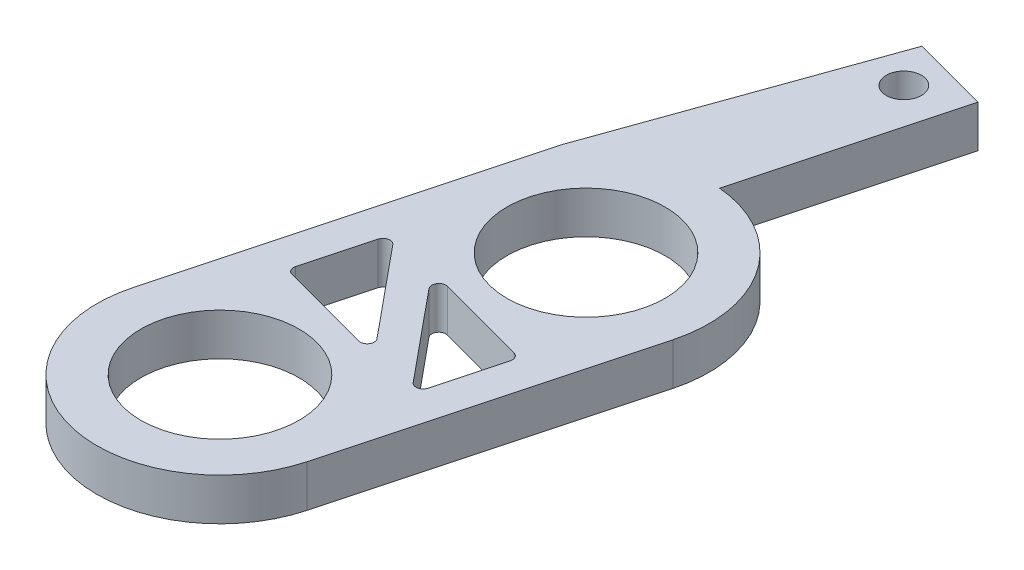
ISO-10303-21;
HEADER;
FILE_DESCRIPTION(('STEP AP214'),'2;1');
FILE_NAME('part.step','',(''),(''),'','','');
FILE_SCHEMA(('AUTOMOTIVE_DESIGN { 1 0 10303 214 1 1 1 1 }'));
ENDSEC;
DATA;
#1=APPLICATION_CONTEXT('core data for automotive mechanical design processes');
#2=APPLICATION_PROTOCOL_DEFINITION('international standard','automotive_design',2000,#1);
#3=PRODUCT_CONTEXT('',#1,'mechanical');
#4=PRODUCT('Part','Part','',(#3));
#5=PRODUCT_RELATED_PRODUCT_CATEGORY('part','',(#4));
#6=PRODUCT_DEFINITION_FORMATION('','',#4);
#7=PRODUCT_DEFINITION_CONTEXT('part definition',#1,'design');
#8=PRODUCT_DEFINITION('design','',#6,#7);
#9=PRODUCT_DEFINITION_SHAPE('','',#8);
#10=(LENGTH_UNIT() NAMED_UNIT(*) SI_UNIT(.MILLI.,.METRE.));
#11=(NAMED_UNIT(*) PLANE_ANGLE_UNIT() SI_UNIT($,.RADIAN.));
#12=(NAMED_UNIT(*) SI_UNIT($,.STERADIAN.) SOLID_ANGLE_UNIT());
#13=UNCERTAINTY_MEASURE_WITH_UNIT(LENGTH_MEASURE(1.E-05),#10,'distance_accuracy_value','');
#14=(GEOMETRIC_REPRESENTATION_CONTEXT(3) GLOBAL_UNCERTAINTY_ASSIGNED_CONTEXT((#13)) GLOBAL_UNIT_ASSIGNED_CONTEXT((#10,
#11,#12)) REPRESENTATION_CONTEXT('',''));
#15=CARTESIAN_POINT('',(0.,0.,0.));
#16=DIRECTION('',(0.,0.,1.));
#17=DIRECTION('',(1.,0.,0.));
#18=AXIS2_PLACEMENT_3D('',#15,#16,#17);
#19=CARTESIAN_POINT('',(0.,7.62,0.));
#20=DIRECTION('',(0.,1.,0.));
#21=DIRECTION('',(0.,0.,1.));
#22=AXIS2_PLACEMENT_3D('',#19,#20,#21);
#23=PLANE('',#22);
#24=CARTESIAN_POINT('',(2.53739112937302,7.62,-54.8585271908195));
#25=DIRECTION('',(0.,1.,0.));
#26=DIRECTION('',(0.,0.,1.));
#27=AXIS2_PLACEMENT_3D('',#24,#25,#26);
#28=CIRCLE('',#27,3.175);
#29=CARTESIAN_POINT('',(2.53739112937302,7.62,-51.6835271908195));
#30=VERTEX_POINT('',#29);
#31=EDGE_CURVE('E646',#30,#30,#28,.T.);
#32=ORIENTED_EDGE('',*,*,#31,.F.);
#33=EDGE_LOOP('',(#32));
#34=FACE_BOUND('',#33,.T.);
#35=DIRECTION('',(0.635570661278952,0.,0.772042702524566));
#36=VECTOR('',#35,1.);
#37=CARTESIAN_POINT('',(6.29481734213367,7.62,37.8437118241482));
#38=LINE('',#37,#36);
#39=CARTESIAN_POINT('',(-8.54537123852275,7.62,19.8169840410739));
#40=VERTEX_POINT('',#39);
#41=CARTESIAN_POINT('',(4.72632400521507,7.62,35.9384259000156));
#42=VERTEX_POINT('',#41);
#43=EDGE_CURVE('E650',#40,#42,#38,.T.);
#44=ORIENTED_EDGE('',*,*,#43,.F.);
#45=CARTESIAN_POINT('',(-7.56487700631655,7.62,19.0098093012496));
#46=DIRECTION('',(0.,1.,0.));
#47=DIRECTION('',(0.,0.,1.));
#48=AXIS2_PLACEMENT_3D('',#45,#46,#47);
#49=CIRCLE('',#48,1.27);
#50=CARTESIAN_POINT('',(-7.23617681903635,7.62,17.7830835018625));
#51=VERTEX_POINT('',#50);
#52=EDGE_CURVE('E279',#40,#51,#49,.F.);
#53=ORIENTED_EDGE('',*,*,#52,.T.);
#54=DIRECTION('',(-0.96592582628907,0.,-0.258819045102514));
#55=VECTOR('',#54,1.);
#56=CARTESIAN_POINT('',(-11.0641318061385,7.62,16.7573860544058));
#57=LINE('',#56,#55);
#58=CARTESIAN_POINT('',(9.17684388374896,7.62,22.180939144529));
#59=VERTEX_POINT('',#58);
#60=EDGE_CURVE('E658',#59,#51,#57,.T.);
#61=ORIENTED_EDGE('',*,*,#60,.F.);
#62=CARTESIAN_POINT('',(8.84814369646877,7.62,23.4076649439161));
#63=DIRECTION('',(0.,1.,0.));
#64=DIRECTION('',(0.,0.,1.));
#65=AXIS2_PLACEMENT_3D('',#62,#63,#64);
#66=CIRCLE('',#65,1.27);
#67=CARTESIAN_POINT('',(10.0748694958559,7.62,23.7363651311963));
#68=VERTEX_POINT('',#67);
#69=EDGE_CURVE('E273',#59,#68,#66,.F.);
#70=ORIENTED_EDGE('',*,*,#69,.T.);
#71=DIRECTION('',(0.258819045102514,0.,-0.96592582628907));
#72=VECTOR('',#71,1.);
#73=CARTESIAN_POINT('',(10.4035696831361,7.62,22.5096393318092));
#74=LINE('',#73,#72);
#75=CARTESIAN_POINT('',(6.93354403680839,7.62,35.4599513474715));
#76=VERTEX_POINT('',#75);
#77=EDGE_CURVE('E668',#76,#68,#74,.T.);
#78=ORIENTED_EDGE('',*,*,#77,.F.);
#79=CARTESIAN_POINT('',(5.70681823742127,7.62,35.1312511601913));
#80=DIRECTION('',(0.,1.,0.));
#81=DIRECTION('',(0.,0.,1.));
#82=AXIS2_PLACEMENT_3D('',#79,#80,#81);
#83=CIRCLE('',#82,1.27);
#84=EDGE_CURVE('E267',#76,#42,#83,.F.);
#85=ORIENTED_EDGE('',*,*,#84,.T.);
#86=EDGE_LOOP('',(#44,#53,#61,#70,#78,#85));
#87=FACE_BOUND('',#86,.T.);
#88=DIRECTION('',(-0.258819045102514,0.,0.96592582628907));
#89=VECTOR('',#88,1.);
#90=CARTESIAN_POINT('',(-24.3745304772104,7.62,29.6258848435659));
#91=LINE('',#90,#89);
#92=CARTESIAN_POINT('',(-20.9045048308828,7.62,16.6755728279036));
#93=VERTEX_POINT('',#92);
#94=CARTESIAN_POINT('',(-24.0458302899302,7.62,28.3991590441788));
#95=VERTEX_POINT('',#94);
#96=EDGE_CURVE('E306',#93,#95,#91,.T.);
#97=ORIENTED_EDGE('',*,*,#96,.F.);
#98=CARTESIAN_POINT('',(-19.6777790314956,7.62,17.0042730151838));
#99=DIRECTION('',(0.,1.,0.));
#100=DIRECTION('',(0.,0.,1.));
#101=AXIS2_PLACEMENT_3D('',#98,#99,#100);
#102=CIRCLE('',#101,1.27);
#103=CARTESIAN_POINT('',(-18.6972847992894,7.62,16.1970982753595));
#104=VERTEX_POINT('',#103);
#105=EDGE_CURVE('E283',#93,#104,#102,.F.);
#106=ORIENTED_EDGE('',*,*,#105,.T.);
#107=DIRECTION('',(-0.635570661278952,0.,-0.772042702524566));
#108=VECTOR('',#107,1.);
#109=CARTESIAN_POINT('',(-20.265778136208,7.62,14.2918123512269));
#110=LINE('',#109,#108);
#111=CARTESIAN_POINT('',(-5.42558955555161,7.62,32.3185401343012));
#112=VERTEX_POINT('',#111);
#113=EDGE_CURVE('E300',#112,#104,#110,.T.);
#114=ORIENTED_EDGE('',*,*,#113,.F.);
#115=CARTESIAN_POINT('',(-6.40608378775781,7.62,33.1257148741255));
#116=DIRECTION('',(0.,1.,0.));
#117=DIRECTION('',(0.,0.,1.));
#118=AXIS2_PLACEMENT_3D('',#115,#116,#117);
#119=CIRCLE('',#118,1.27);
#120=CARTESIAN_POINT('',(-6.734783975038,7.62,34.3524406735126));
#121=VERTEX_POINT('',#120);
#122=EDGE_CURVE('E49',#112,#121,#119,.F.);
#123=ORIENTED_EDGE('',*,*,#122,.T.);
#124=DIRECTION('',(0.96592582628907,0.,0.258819045102514));
#125=VECTOR('',#124,1.);
#126=CARTESIAN_POINT('',(-2.90682898793586,7.62,35.3781381209693));
#127=LINE('',#126,#125);
#128=CARTESIAN_POINT('',(-23.1478046778233,7.62,29.9545850308461));
#129=VERTEX_POINT('',#128);
#130=EDGE_CURVE('E298',#129,#121,#127,.T.);
#131=ORIENTED_EDGE('',*,*,#130,.F.);
#132=CARTESIAN_POINT('',(-22.8191044905431,7.62,28.727859231459));
#133=DIRECTION('',(0.,1.,0.));
#134=DIRECTION('',(0.,0.,1.));
#135=AXIS2_PLACEMENT_3D('',#132,#133,#134);
#136=CIRCLE('',#135,1.27);
#137=EDGE_CURVE('E289',#129,#95,#136,.F.);
#138=ORIENTED_EDGE('',*,*,#137,.T.);
#139=EDGE_LOOP('',(#97,#106,#114,#123,#131,#138));
#140=FACE_BOUND('',#139,.T.);
#141=CARTESIAN_POINT('',(-13.9697579594082,7.62,52.1358464739526));
#142=DIRECTION('',(0.,1.,0.));
#143=DIRECTION('',(0.,0.,1.));
#144=AXIS2_PLACEMENT_3D('',#141,#142,#143);
#145=CIRCLE('',#144,14.2875);
#146=CARTESIAN_POINT('',(-13.9697579594082,7.62,66.4233464739526));
#147=VERTEX_POINT('',#146);
#148=EDGE_CURVE('E340',#147,#147,#145,.T.);
#149=ORIENTED_EDGE('',*,*,#148,.F.);
#150=EDGE_LOOP('',(#149));
#151=FACE_BOUND('',#150,.T.);
#152=CARTESIAN_POINT('',(0.,7.62,0.));
#153=DIRECTION('',(0.,1.,0.));
#154=DIRECTION('',(0.,0.,1.));
#155=AXIS2_PLACEMENT_3D('',#152,#153,#154);
#156=CIRCLE('',#155,22.225);
#157=CARTESIAN_POINT('',(21.4677014892746,7.62,5.75225327740336));
#158=VERTEX_POINT('',#157);
#159=CARTESIAN_POINT('',(1.9869226935377,7.62,-22.1360060356403));
#160=VERTEX_POINT('',#159);
#161=EDGE_CURVE('E206',#158,#160,#156,.T.);
#162=ORIENTED_EDGE('',*,*,#161,.T.);
#163=DIRECTION('',(0.258819045102514,0.,-0.96592582628907));
#164=VECTOR('',#163,1.);
#165=CARTESIAN_POINT('',(11.8479283119435,7.62,-58.9377800172539));
#166=LINE('',#165,#164);
#167=CARTESIAN_POINT('',(11.8479283119435,7.62,-58.9377800172539));
#168=VERTEX_POINT('',#167);
#169=EDGE_CURVE('E194',#160,#168,#166,.T.);
#170=ORIENTED_EDGE('',*,*,#169,.T.);
#171=DIRECTION('',(-0.96592582628907,0.,-0.258819045102513));
#172=VECTOR('',#171,1.);
#173=CARTESIAN_POINT('',(-1.95273693116161,7.62,-62.6356571241561));
#174=LINE('',#173,#172);
#175=CARTESIAN_POINT('',(-1.95273693116161,7.62,-62.6356571241561));
#176=VERTEX_POINT('',#175);
#177=EDGE_CURVE('E205',#168,#176,#174,.T.);
#178=ORIENTED_EDGE('',*,*,#177,.T.);
#179=DIRECTION('',(-0.336444798827051,0.,0.941703189620926));
#180=VECTOR('',#179,1.);
#181=CARTESIAN_POINT('',(-19.0441327115758,7.62,-14.797135091413));
#182=LINE('',#181,#180);
#183=CARTESIAN_POINT('',(-19.0441327115758,7.62,-14.797135091413));
#184=VERTEX_POINT('',#183);
#185=EDGE_CURVE('E349',#176,#184,#182,.T.);
#186=ORIENTED_EDGE('',*,*,#185,.T.);
#187=DIRECTION('',(-0.258819045102514,0.,0.96592582628907));
#188=VECTOR('',#187,1.);
#189=CARTESIAN_POINT('',(-35.4374594486828,7.62,46.3835931965492));
#190=LINE('',#189,#188);
#191=CARTESIAN_POINT('',(-35.4374594486828,7.62,46.3835931965492));
#192=VERTEX_POINT('',#191);
#193=EDGE_CURVE('E352',#184,#192,#190,.T.);
#194=ORIENTED_EDGE('',*,*,#193,.T.);
#195=CARTESIAN_POINT('',(-13.9697579594082,7.62,52.1358464739526));
#196=DIRECTION('',(0.,1.,0.));
#197=DIRECTION('',(0.,0.,1.));
#198=AXIS2_PLACEMENT_3D('',#195,#196,#197);
#199=CIRCLE('',#198,22.225);
#200=CARTESIAN_POINT('',(7.49794352986639,7.62,57.8880997513559));
#201=VERTEX_POINT('',#200);
#202=EDGE_CURVE('E355',#192,#201,#199,.T.);
#203=ORIENTED_EDGE('',*,*,#202,.T.);
#204=DIRECTION('',(0.258819045102514,0.,-0.96592582628907));
#205=VECTOR('',#204,1.);
#206=CARTESIAN_POINT('',(7.49794352986638,7.62,57.8880997513559));
#207=LINE('',#206,#205);
#208=EDGE_CURVE('E211',#201,#158,#207,.T.);
#209=ORIENTED_EDGE('',*,*,#208,.T.);
#210=EDGE_LOOP('',(#162,#170,#178,#186,#194,#203,#209));
#211=FACE_BOUND('',#210,.T.);
#212=CARTESIAN_POINT('',(0.,7.62,0.));
#213=DIRECTION('',(0.,1.,0.));
#214=DIRECTION('',(0.,0.,1.));
#215=AXIS2_PLACEMENT_3D('',#212,#213,#214);
#216=CIRCLE('',#215,14.2875);
#217=CARTESIAN_POINT('',(0.,7.62,14.2875));
#218=VERTEX_POINT('',#217);
#219=EDGE_CURVE('E323',#218,#218,#216,.T.);
#220=ORIENTED_EDGE('',*,*,#219,.F.);
#221=EDGE_LOOP('',(#220));
#222=FACE_BOUND('',#221,.T.);
#223=ADVANCED_FACE('F41',(#34,#87,#140,#151,#211,#222),#23,.T.);
#224=CARTESIAN_POINT('',(0.,0.,0.));
#225=DIRECTION('',(0.,1.,0.));
#226=DIRECTION('',(0.,0.,1.));
#227=AXIS2_PLACEMENT_3D('',#224,#225,#226);
#228=PLANE('',#227);
#229=CARTESIAN_POINT('',(2.53739112937302,0.,-54.8585271908195));
#230=DIRECTION('',(0.,1.,0.));
#231=DIRECTION('',(0.,0.,1.));
#232=AXIS2_PLACEMENT_3D('',#229,#230,#231);
#233=CIRCLE('',#232,3.175);
#234=CARTESIAN_POINT('',(2.53739112937302,0.,-51.6835271908195));
#235=VERTEX_POINT('',#234);
#236=EDGE_CURVE('E644',#235,#235,#233,.F.);
#237=ORIENTED_EDGE('',*,*,#236,.F.);
#238=EDGE_LOOP('',(#237));
#239=FACE_BOUND('',#238,.T.);
#240=DIRECTION('',(0.258819045102514,0.,-0.96592582628907));
#241=VECTOR('',#240,1.);
#242=CARTESIAN_POINT('',(10.4035696831361,0.,22.5096393318092));
#243=LINE('',#242,#241);
#244=CARTESIAN_POINT('',(6.93354403680839,0.,35.4599513474715));
#245=VERTEX_POINT('',#244);
#246=CARTESIAN_POINT('',(10.0748694958559,0.,23.7363651311963));
#247=VERTEX_POINT('',#246);
#248=EDGE_CURVE('E657',#245,#247,#243,.T.);
#249=ORIENTED_EDGE('',*,*,#248,.T.);
#250=CARTESIAN_POINT('',(8.84814369646877,0.,23.4076649439161));
#251=DIRECTION('',(0.,1.,0.));
#252=DIRECTION('',(0.,0.,1.));
#253=AXIS2_PLACEMENT_3D('',#250,#251,#252);
#254=CIRCLE('',#253,1.27);
#255=CARTESIAN_POINT('',(9.17684388374896,0.,22.180939144529));
#256=VERTEX_POINT('',#255);
#257=EDGE_CURVE('E276',#247,#256,#254,.T.);
#258=ORIENTED_EDGE('',*,*,#257,.T.);
#259=DIRECTION('',(-0.96592582628907,0.,-0.258819045102514));
#260=VECTOR('',#259,1.);
#261=CARTESIAN_POINT('',(-11.0641318061385,0.,16.7573860544058));
#262=LINE('',#261,#260);
#263=CARTESIAN_POINT('',(-7.23617681903635,0.,17.7830835018625));
#264=VERTEX_POINT('',#263);
#265=EDGE_CURVE('E332',#256,#264,#262,.T.);
#266=ORIENTED_EDGE('',*,*,#265,.T.);
#267=CARTESIAN_POINT('',(-7.56487700631655,0.,19.0098093012496));
#268=DIRECTION('',(0.,1.,0.));
#269=DIRECTION('',(0.,0.,1.));
#270=AXIS2_PLACEMENT_3D('',#267,#268,#269);
#271=CIRCLE('',#270,1.27);
#272=CARTESIAN_POINT('',(-8.54537123852275,0.,19.8169840410739));
#273=VERTEX_POINT('',#272);
#274=EDGE_CURVE('E281',#264,#273,#271,.T.);
#275=ORIENTED_EDGE('',*,*,#274,.T.);
#276=DIRECTION('',(0.635570661278952,0.,0.772042702524566));
#277=VECTOR('',#276,1.);
#278=CARTESIAN_POINT('',(6.29481734213367,0.,37.8437118241482));
#279=LINE('',#278,#277);
#280=CARTESIAN_POINT('',(4.72632400521507,0.,35.9384259000156));
#281=VERTEX_POINT('',#280);
#282=EDGE_CURVE('E653',#273,#281,#279,.T.);
#283=ORIENTED_EDGE('',*,*,#282,.T.);
#284=CARTESIAN_POINT('',(5.70681823742127,0.,35.1312511601913));
#285=DIRECTION('',(0.,1.,0.));
#286=DIRECTION('',(0.,0.,1.));
#287=AXIS2_PLACEMENT_3D('',#284,#285,#286);
#288=CIRCLE('',#287,1.27);
#289=EDGE_CURVE('E270',#281,#245,#288,.T.);
#290=ORIENTED_EDGE('',*,*,#289,.T.);
#291=EDGE_LOOP('',(#249,#258,#266,#275,#283,#290));
#292=FACE_BOUND('',#291,.T.);
#293=DIRECTION('',(0.96592582628907,0.,0.258819045102514));
#294=VECTOR('',#293,1.);
#295=CARTESIAN_POINT('',(-2.90682898793586,0.,35.3781381209693));
#296=LINE('',#295,#294);
#297=CARTESIAN_POINT('',(-23.1478046778233,0.,29.9545850308461));
#298=VERTEX_POINT('',#297);
#299=CARTESIAN_POINT('',(-6.734783975038,0.,34.3524406735126));
#300=VERTEX_POINT('',#299);
#301=EDGE_CURVE('E315',#298,#300,#296,.T.);
#302=ORIENTED_EDGE('',*,*,#301,.T.);
#303=CARTESIAN_POINT('',(-6.40608378775781,0.,33.1257148741255));
#304=DIRECTION('',(0.,1.,0.));
#305=DIRECTION('',(0.,0.,1.));
#306=AXIS2_PLACEMENT_3D('',#303,#304,#305);
#307=CIRCLE('',#306,1.27);
#308=CARTESIAN_POINT('',(-5.42558955555161,0.,32.3185401343012));
#309=VERTEX_POINT('',#308);
#310=EDGE_CURVE('E11',#300,#309,#307,.T.);
#311=ORIENTED_EDGE('',*,*,#310,.T.);
#312=DIRECTION('',(-0.635570661278952,0.,-0.772042702524566));
#313=VECTOR('',#312,1.);
#314=CARTESIAN_POINT('',(-20.265778136208,0.,14.2918123512269));
#315=LINE('',#314,#313);
#316=CARTESIAN_POINT('',(-18.6972847992894,0.,16.1970982753595));
#317=VERTEX_POINT('',#316);
#318=EDGE_CURVE('E313',#309,#317,#315,.T.);
#319=ORIENTED_EDGE('',*,*,#318,.T.);
#320=CARTESIAN_POINT('',(-19.6777790314956,0.,17.0042730151838));
#321=DIRECTION('',(0.,1.,0.));
#322=DIRECTION('',(0.,0.,1.));
#323=AXIS2_PLACEMENT_3D('',#320,#321,#322);
#324=CIRCLE('',#323,1.27);
#325=CARTESIAN_POINT('',(-20.9045048308828,0.,16.6755728279036));
#326=VERTEX_POINT('',#325);
#327=EDGE_CURVE('E286',#317,#326,#324,.T.);
#328=ORIENTED_EDGE('',*,*,#327,.T.);
#329=DIRECTION('',(-0.258819045102514,0.,0.96592582628907));
#330=VECTOR('',#329,1.);
#331=CARTESIAN_POINT('',(-24.3745304772104,0.,29.6258848435659));
#332=LINE('',#331,#330);
#333=CARTESIAN_POINT('',(-24.0458302899302,0.,28.3991590441788));
#334=VERTEX_POINT('',#333);
#335=EDGE_CURVE('E326',#326,#334,#332,.T.);
#336=ORIENTED_EDGE('',*,*,#335,.T.);
#337=CARTESIAN_POINT('',(-22.8191044905431,0.,28.727859231459));
#338=DIRECTION('',(0.,1.,0.));
#339=DIRECTION('',(0.,0.,1.));
#340=AXIS2_PLACEMENT_3D('',#337,#338,#339);
#341=CIRCLE('',#340,1.27);
#342=EDGE_CURVE('E66',#334,#298,#341,.T.);
#343=ORIENTED_EDGE('',*,*,#342,.T.);
#344=EDGE_LOOP('',(#302,#311,#319,#328,#336,#343));
#345=FACE_BOUND('',#344,.T.);
#346=CARTESIAN_POINT('',(0.,0.,0.));
#347=DIRECTION('',(0.,1.,0.));
#348=DIRECTION('',(0.,0.,1.));
#349=AXIS2_PLACEMENT_3D('',#346,#347,#348);
#350=CIRCLE('',#349,22.225);
#351=CARTESIAN_POINT('',(21.4677014892746,0.,5.75225327740336));
#352=VERTEX_POINT('',#351);
#353=CARTESIAN_POINT('',(1.9869226935377,0.,-22.1360060356403));
#354=VERTEX_POINT('',#353);
#355=EDGE_CURVE('E220',#352,#354,#350,.T.);
#356=ORIENTED_EDGE('',*,*,#355,.F.);
#357=DIRECTION('',(0.258819045102514,0.,-0.96592582628907));
#358=VECTOR('',#357,1.);
#359=CARTESIAN_POINT('',(7.49794352986638,0.,57.8880997513559));
#360=LINE('',#359,#358);
#361=CARTESIAN_POINT('',(7.49794352986639,0.,57.8880997513559));
#362=VERTEX_POINT('',#361);
#363=EDGE_CURVE('E216',#362,#352,#360,.T.);
#364=ORIENTED_EDGE('',*,*,#363,.F.);
#365=CARTESIAN_POINT('',(-13.9697579594082,0.,52.1358464739526));
#366=DIRECTION('',(0.,1.,0.));
#367=DIRECTION('',(0.,0.,1.));
#368=AXIS2_PLACEMENT_3D('',#365,#366,#367);
#369=CIRCLE('',#368,22.225);
#370=CARTESIAN_POINT('',(-35.4374594486828,0.,46.3835931965492));
#371=VERTEX_POINT('',#370);
#372=EDGE_CURVE('E373',#371,#362,#369,.T.);
#373=ORIENTED_EDGE('',*,*,#372,.F.);
#374=DIRECTION('',(-0.258819045102514,0.,0.96592582628907));
#375=VECTOR('',#374,1.);
#376=CARTESIAN_POINT('',(-35.4374594486828,0.,46.3835931965492));
#377=LINE('',#376,#375);
#378=CARTESIAN_POINT('',(-19.0441327115758,0.,-14.797135091413));
#379=VERTEX_POINT('',#378);
#380=EDGE_CURVE('E370',#379,#371,#377,.T.);
#381=ORIENTED_EDGE('',*,*,#380,.F.);
#382=DIRECTION('',(-0.336444798827051,0.,0.941703189620926));
#383=VECTOR('',#382,1.);
#384=CARTESIAN_POINT('',(-19.0441327115758,0.,-14.797135091413));
#385=LINE('',#384,#383);
#386=CARTESIAN_POINT('',(-1.95273693116161,0.,-62.6356571241561));
#387=VERTEX_POINT('',#386);
#388=EDGE_CURVE('E367',#387,#379,#385,.T.);
#389=ORIENTED_EDGE('',*,*,#388,.F.);
#390=DIRECTION('',(-0.96592582628907,0.,-0.258819045102513));
#391=VECTOR('',#390,1.);
#392=CARTESIAN_POINT('',(-1.95273693116161,0.,-62.6356571241561));
#393=LINE('',#392,#391);
#394=CARTESIAN_POINT('',(11.8479283119435,0.,-58.9377800172539));
#395=VERTEX_POINT('',#394);
#396=EDGE_CURVE('E364',#395,#387,#393,.T.);
#397=ORIENTED_EDGE('',*,*,#396,.F.);
#398=DIRECTION('',(0.258819045102514,0.,-0.96592582628907));
#399=VECTOR('',#398,1.);
#400=CARTESIAN_POINT('',(11.8479283119435,0.,-58.9377800172539));
#401=LINE('',#400,#399);
#402=EDGE_CURVE('E362',#354,#395,#401,.T.);
#403=ORIENTED_EDGE('',*,*,#402,.F.);
#404=EDGE_LOOP('',(#356,#364,#373,#381,#389,#397,#403));
#405=FACE_BOUND('',#404,.T.);
#406=CARTESIAN_POINT('',(-13.9697579594082,0.,52.1358464739526));
#407=DIRECTION('',(0.,1.,0.));
#408=DIRECTION('',(0.,0.,1.));
#409=AXIS2_PLACEMENT_3D('',#406,#407,#408);
#410=CIRCLE('',#409,14.2875);
#411=CARTESIAN_POINT('',(-13.9697579594082,0.,66.4233464739526));
#412=VERTEX_POINT('',#411);
#413=EDGE_CURVE('E338',#412,#412,#410,.T.);
#414=ORIENTED_EDGE('',*,*,#413,.T.);
#415=EDGE_LOOP('',(#414));
#416=FACE_BOUND('',#415,.T.);
#417=CARTESIAN_POINT('',(0.,0.,0.));
#418=DIRECTION('',(0.,1.,0.));
#419=DIRECTION('',(0.,0.,1.));
#420=AXIS2_PLACEMENT_3D('',#417,#418,#419);
#421=CIRCLE('',#420,14.2875);
#422=CARTESIAN_POINT('',(0.,0.,14.2875));
#423=VERTEX_POINT('',#422);
#424=EDGE_CURVE('E319',#423,#423,#421,.T.);
#425=ORIENTED_EDGE('',*,*,#424,.T.);
#426=EDGE_LOOP('',(#425));
#427=FACE_BOUND('',#426,.T.);
#428=ADVANCED_FACE('F311',(#239,#292,#345,#405,#416,#427),#228,.F.);
#429=CARTESIAN_POINT('',(0.,7.62,0.));
#430=DIRECTION('',(0.,-1.,0.));
#431=DIRECTION('',(0.,0.,-1.));
#432=AXIS2_PLACEMENT_3D('',#429,#430,#431);
#433=CYLINDRICAL_SURFACE('',#432,22.225);
#434=ORIENTED_EDGE('',*,*,#355,.T.);
#435=DIRECTION('',(0.,-1.,0.));
#436=VECTOR('',#435,1.);
#437=CARTESIAN_POINT('',(1.9869226935377,7.62,-22.1360060356403));
#438=LINE('',#437,#436);
#439=EDGE_CURVE('E198',#160,#354,#438,.T.);
#440=ORIENTED_EDGE('',*,*,#439,.F.);
#441=ORIENTED_EDGE('',*,*,#161,.F.);
#442=DIRECTION('',(0.,-1.,0.));
#443=VECTOR('',#442,1.);
#444=CARTESIAN_POINT('',(21.4677014892746,7.62,5.75225327740336));
#445=LINE('',#444,#443);
#446=EDGE_CURVE('E360',#158,#352,#445,.T.);
#447=ORIENTED_EDGE('',*,*,#446,.T.);
#448=EDGE_LOOP('',(#434,#440,#441,#447));
#449=FACE_BOUND('',#448,.T.);
#450=ADVANCED_FACE('F218',(#449),#433,.T.);
#451=CARTESIAN_POINT('',(11.8479283119435,7.62,-58.9377800172539));
#452=DIRECTION('',(-0.96592582628907,0.,-0.258819045102514));
#453=DIRECTION('',(-0.258819045102514,0.,0.96592582628907));
#454=AXIS2_PLACEMENT_3D('',#451,#452,#453);
#455=PLANE('',#454);
#456=ORIENTED_EDGE('',*,*,#402,.T.);
#457=DIRECTION('',(0.,-1.,0.));
#458=VECTOR('',#457,1.);
#459=CARTESIAN_POINT('',(11.8479283119435,7.62,-58.9377800172539));
#460=LINE('',#459,#458);
#461=EDGE_CURVE('E201',#168,#395,#460,.T.);
#462=ORIENTED_EDGE('',*,*,#461,.F.);
#463=ORIENTED_EDGE('',*,*,#169,.F.);
#464=ORIENTED_EDGE('',*,*,#439,.T.);
#465=EDGE_LOOP('',(#456,#462,#463,#464));
#466=FACE_BOUND('',#465,.T.);
#467=ADVANCED_FACE('F196',(#466),#455,.F.);
#468=CARTESIAN_POINT('',(-1.95273693116161,7.62,-62.6356571241561));
#469=DIRECTION('',(-0.258819045102513,0.,0.96592582628907));
#470=DIRECTION('',(0.96592582628907,0.,0.258819045102513));
#471=AXIS2_PLACEMENT_3D('',#468,#469,#470);
#472=PLANE('',#471);
#473=ORIENTED_EDGE('',*,*,#396,.T.);
#474=DIRECTION('',(0.,-1.,0.));
#475=VECTOR('',#474,1.);
#476=CARTESIAN_POINT('',(-1.95273693116161,7.62,-62.6356571241561));
#477=LINE('',#476,#475);
#478=EDGE_CURVE('E230',#176,#387,#477,.T.);
#479=ORIENTED_EDGE('',*,*,#478,.F.);
#480=ORIENTED_EDGE('',*,*,#177,.F.);
#481=ORIENTED_EDGE('',*,*,#461,.T.);
#482=EDGE_LOOP('',(#473,#479,#480,#481));
#483=FACE_BOUND('',#482,.T.);
#484=ADVANCED_FACE('F411',(#483),#472,.F.);
#485=CARTESIAN_POINT('',(-19.0441327115758,7.62,-14.797135091413));
#486=DIRECTION('',(0.941703189620926,0.,0.336444798827051));
#487=DIRECTION('',(0.336444798827051,0.,-0.941703189620926));
#488=AXIS2_PLACEMENT_3D('',#485,#486,#487);
#489=PLANE('',#488);
#490=ORIENTED_EDGE('',*,*,#388,.T.);
#491=DIRECTION('',(0.,-1.,0.));
#492=VECTOR('',#491,1.);
#493=CARTESIAN_POINT('',(-19.0441327115758,7.62,-14.797135091413));
#494=LINE('',#493,#492);
#495=EDGE_CURVE('E387',#184,#379,#494,.T.);
#496=ORIENTED_EDGE('',*,*,#495,.F.);
#497=ORIENTED_EDGE('',*,*,#185,.F.);
#498=ORIENTED_EDGE('',*,*,#478,.T.);
#499=EDGE_LOOP('',(#490,#496,#497,#498));
#500=FACE_BOUND('',#499,.T.);
#501=ADVANCED_FACE('F395',(#500),#489,.F.);
#502=CARTESIAN_POINT('',(-35.4374594486828,7.62,46.3835931965492));
#503=DIRECTION('',(0.96592582628907,0.,0.258819045102514));
#504=DIRECTION('',(0.258819045102514,0.,-0.96592582628907));
#505=AXIS2_PLACEMENT_3D('',#502,#503,#504);
#506=PLANE('',#505);
#507=ORIENTED_EDGE('',*,*,#380,.T.);
#508=DIRECTION('',(0.,-1.,0.));
#509=VECTOR('',#508,1.);
#510=CARTESIAN_POINT('',(-35.4374594486828,7.62,46.3835931965492));
#511=LINE('',#510,#509);
#512=EDGE_CURVE('E383',#192,#371,#511,.T.);
#513=ORIENTED_EDGE('',*,*,#512,.F.);
#514=ORIENTED_EDGE('',*,*,#193,.F.);
#515=ORIENTED_EDGE('',*,*,#495,.T.);
#516=EDGE_LOOP('',(#507,#513,#514,#515));
#517=FACE_BOUND('',#516,.T.);
#518=ADVANCED_FACE('F405',(#517),#506,.F.);
#519=CARTESIAN_POINT('',(-13.9697579594082,7.62,52.1358464739526));
#520=DIRECTION('',(0.,-1.,0.));
#521=DIRECTION('',(0.,0.,-1.));
#522=AXIS2_PLACEMENT_3D('',#519,#520,#521);
#523=CYLINDRICAL_SURFACE('',#522,22.225);
#524=ORIENTED_EDGE('',*,*,#372,.T.);
#525=DIRECTION('',(0.,-1.,0.));
#526=VECTOR('',#525,1.);
#527=CARTESIAN_POINT('',(7.49794352986639,7.62,57.8880997513559));
#528=LINE('',#527,#526);
#529=EDGE_CURVE('E380',#201,#362,#528,.T.);
#530=ORIENTED_EDGE('',*,*,#529,.F.);
#531=ORIENTED_EDGE('',*,*,#202,.F.);
#532=ORIENTED_EDGE('',*,*,#512,.T.);
#533=EDGE_LOOP('',(#524,#530,#531,#532));
#534=FACE_BOUND('',#533,.T.);
#535=ADVANCED_FACE('F409',(#534),#523,.T.);
#536=CARTESIAN_POINT('',(7.49794352986638,7.62,57.8880997513559));
#537=DIRECTION('',(-0.96592582628907,0.,-0.258819045102514));
#538=DIRECTION('',(-0.258819045102514,0.,0.96592582628907));
#539=AXIS2_PLACEMENT_3D('',#536,#537,#538);
#540=PLANE('',#539);
#541=ORIENTED_EDGE('',*,*,#363,.T.);
#542=ORIENTED_EDGE('',*,*,#446,.F.);
#543=ORIENTED_EDGE('',*,*,#208,.F.);
#544=ORIENTED_EDGE('',*,*,#529,.T.);
#545=EDGE_LOOP('',(#541,#542,#543,#544));
#546=FACE_BOUND('',#545,.T.);
#547=ADVANCED_FACE('F434',(#546),#540,.F.);
#548=CARTESIAN_POINT('',(-13.9697579594082,7.62,52.1358464739526));
#549=DIRECTION('',(0.,-1.,0.));
#550=DIRECTION('',(0.,0.,-1.));
#551=AXIS2_PLACEMENT_3D('',#548,#549,#550);
#552=CYLINDRICAL_SURFACE('',#551,14.2875);
#553=ORIENTED_EDGE('',*,*,#148,.T.);
#554=EDGE_LOOP('',(#553));
#555=FACE_BOUND('',#554,.T.);
#556=ORIENTED_EDGE('',*,*,#413,.F.);
#557=EDGE_LOOP('',(#556));
#558=FACE_BOUND('',#557,.T.);
#559=ADVANCED_FACE('F431',(#555,#558),#552,.F.);
#560=CARTESIAN_POINT('',(0.,7.62,0.));
#561=DIRECTION('',(0.,-1.,0.));
#562=DIRECTION('',(0.,0.,-1.));
#563=AXIS2_PLACEMENT_3D('',#560,#561,#562);
#564=CYLINDRICAL_SURFACE('',#563,14.2875);
#565=ORIENTED_EDGE('',*,*,#219,.T.);
#566=EDGE_LOOP('',(#565));
#567=FACE_BOUND('',#566,.T.);
#568=ORIENTED_EDGE('',*,*,#424,.F.);
#569=EDGE_LOOP('',(#568));
#570=FACE_BOUND('',#569,.T.);
#571=ADVANCED_FACE('F460',(#567,#570),#564,.F.);
#572=CARTESIAN_POINT('',(-24.3745304772104,0.,29.6258848435659));
#573=DIRECTION('',(-0.96592582628907,0.,-0.258819045102514));
#574=DIRECTION('',(-0.258819045102514,0.,0.96592582628907));
#575=AXIS2_PLACEMENT_3D('',#572,#573,#574);
#576=PLANE('',#575);
#577=ORIENTED_EDGE('',*,*,#335,.F.);
#578=DIRECTION('',(0.,1.,0.));
#579=VECTOR('',#578,1.);
#580=CARTESIAN_POINT('',(-20.9045048308828,7.62,16.6755728279036));
#581=LINE('',#580,#579);
#582=EDGE_CURVE('E252',#326,#93,#581,.T.);
#583=ORIENTED_EDGE('',*,*,#582,.T.);
#584=ORIENTED_EDGE('',*,*,#96,.T.);
#585=DIRECTION('',(0.,1.,0.));
#586=VECTOR('',#585,1.);
#587=CARTESIAN_POINT('',(-24.0458302899302,0.,28.3991590441788));
#588=LINE('',#587,#586);
#589=EDGE_CURVE('E249',#95,#334,#588,.F.);
#590=ORIENTED_EDGE('',*,*,#589,.T.);
#591=EDGE_LOOP('',(#577,#583,#584,#590));
#592=FACE_BOUND('',#591,.T.);
#593=ADVANCED_FACE('F466',(#592),#576,.F.);
#594=CARTESIAN_POINT('',(-20.265778136208,0.,14.2918123512269));
#595=DIRECTION('',(0.772042702524566,0.,-0.635570661278952));
#596=DIRECTION('',(-0.635570661278952,0.,-0.772042702524566));
#597=AXIS2_PLACEMENT_3D('',#594,#595,#596);
#598=PLANE('',#597);
#599=ORIENTED_EDGE('',*,*,#113,.T.);
#600=DIRECTION('',(0.,1.,0.));
#601=VECTOR('',#600,1.);
#602=CARTESIAN_POINT('',(-18.6972847992894,0.,16.1970982753595));
#603=LINE('',#602,#601);
#604=EDGE_CURVE('E259',#104,#317,#603,.F.);
#605=ORIENTED_EDGE('',*,*,#604,.T.);
#606=ORIENTED_EDGE('',*,*,#318,.F.);
#607=DIRECTION('',(0.,1.,0.));
#608=VECTOR('',#607,1.);
#609=CARTESIAN_POINT('',(-5.42558955555161,7.62,32.3185401343012));
#610=LINE('',#609,#608);
#611=EDGE_CURVE('E256',#309,#112,#610,.T.);
#612=ORIENTED_EDGE('',*,*,#611,.T.);
#613=EDGE_LOOP('',(#599,#605,#606,#612));
#614=FACE_BOUND('',#613,.T.);
#615=ADVANCED_FACE('F317',(#614),#598,.F.);
#616=CARTESIAN_POINT('',(-2.90682898793586,0.,35.3781381209693));
#617=DIRECTION('',(-0.258819045102514,0.,0.96592582628907));
#618=DIRECTION('',(0.96592582628907,0.,0.258819045102514));
#619=AXIS2_PLACEMENT_3D('',#616,#617,#618);
#620=PLANE('',#619);
#621=ORIENTED_EDGE('',*,*,#301,.F.);
#622=DIRECTION('',(0.,1.,0.));
#623=VECTOR('',#622,1.);
#624=CARTESIAN_POINT('',(-23.1478046778233,7.62,29.9545850308461));
#625=LINE('',#624,#623);
#626=EDGE_CURVE('E263',#298,#129,#625,.T.);
#627=ORIENTED_EDGE('',*,*,#626,.T.);
#628=ORIENTED_EDGE('',*,*,#130,.T.);
#629=DIRECTION('',(0.,1.,0.));
#630=VECTOR('',#629,1.);
#631=CARTESIAN_POINT('',(-6.734783975038,0.,34.3524406735126));
#632=LINE('',#631,#630);
#633=EDGE_CURVE('E56',#121,#300,#632,.F.);
#634=ORIENTED_EDGE('',*,*,#633,.T.);
#635=EDGE_LOOP('',(#621,#627,#628,#634));
#636=FACE_BOUND('',#635,.T.);
#637=ADVANCED_FACE('F303',(#636),#620,.F.);
#638=CARTESIAN_POINT('',(6.29481734213367,0.,37.8437118241482));
#639=DIRECTION('',(-0.772042702524566,0.,0.635570661278952));
#640=DIRECTION('',(0.635570661278952,0.,0.772042702524566));
#641=AXIS2_PLACEMENT_3D('',#638,#639,#640);
#642=PLANE('',#641);
#643=ORIENTED_EDGE('',*,*,#43,.T.);
#644=DIRECTION('',(0.,1.,0.));
#645=VECTOR('',#644,1.);
#646=CARTESIAN_POINT('',(4.72632400521507,0.,35.9384259000156));
#647=LINE('',#646,#645);
#648=EDGE_CURVE('E240',#42,#281,#647,.F.);
#649=ORIENTED_EDGE('',*,*,#648,.T.);
#650=ORIENTED_EDGE('',*,*,#282,.F.);
#651=DIRECTION('',(0.,1.,0.));
#652=VECTOR('',#651,1.);
#653=CARTESIAN_POINT('',(-8.54537123852275,7.62,19.8169840410739));
#654=LINE('',#653,#652);
#655=EDGE_CURVE('E237',#273,#40,#654,.T.);
#656=ORIENTED_EDGE('',*,*,#655,.T.);
#657=EDGE_LOOP('',(#643,#649,#650,#656));
#658=FACE_BOUND('',#657,.T.);
#659=ADVANCED_FACE('F487',(#658),#642,.F.);
#660=CARTESIAN_POINT('',(-11.0641318061385,0.,16.7573860544058));
#661=DIRECTION('',(0.258819045102514,0.,-0.96592582628907));
#662=DIRECTION('',(-0.96592582628907,0.,-0.258819045102514));
#663=AXIS2_PLACEMENT_3D('',#660,#661,#662);
#664=PLANE('',#663);
#665=ORIENTED_EDGE('',*,*,#265,.F.);
#666=DIRECTION('',(0.,1.,0.));
#667=VECTOR('',#666,1.);
#668=CARTESIAN_POINT('',(9.17684388374896,7.62,22.180939144529));
#669=LINE('',#668,#667);
#670=EDGE_CURVE('E245',#256,#59,#669,.T.);
#671=ORIENTED_EDGE('',*,*,#670,.T.);
#672=ORIENTED_EDGE('',*,*,#60,.T.);
#673=DIRECTION('',(0.,1.,0.));
#674=VECTOR('',#673,1.);
#675=CARTESIAN_POINT('',(-7.23617681903635,0.,17.7830835018625));
#676=LINE('',#675,#674);
#677=EDGE_CURVE('E243',#51,#264,#676,.F.);
#678=ORIENTED_EDGE('',*,*,#677,.T.);
#679=EDGE_LOOP('',(#665,#671,#672,#678));
#680=FACE_BOUND('',#679,.T.);
#681=ADVANCED_FACE('F494',(#680),#664,.F.);
#682=CARTESIAN_POINT('',(10.4035696831361,0.,22.5096393318092));
#683=DIRECTION('',(0.96592582628907,0.,0.258819045102514));
#684=DIRECTION('',(0.258819045102514,0.,-0.96592582628907));
#685=AXIS2_PLACEMENT_3D('',#682,#683,#684);
#686=PLANE('',#685);
#687=ORIENTED_EDGE('',*,*,#248,.F.);
#688=DIRECTION('',(0.,1.,0.));
#689=VECTOR('',#688,1.);
#690=CARTESIAN_POINT('',(6.93354403680839,7.62,35.4599513474715));
#691=LINE('',#690,#689);
#692=EDGE_CURVE('E227',#245,#76,#691,.T.);
#693=ORIENTED_EDGE('',*,*,#692,.T.);
#694=ORIENTED_EDGE('',*,*,#77,.T.);
#695=DIRECTION('',(0.,1.,0.));
#696=VECTOR('',#695,1.);
#697=CARTESIAN_POINT('',(10.0748694958559,0.,23.7363651311963));
#698=LINE('',#697,#696);
#699=EDGE_CURVE('E222',#68,#247,#698,.F.);
#700=ORIENTED_EDGE('',*,*,#699,.T.);
#701=EDGE_LOOP('',(#687,#693,#694,#700));
#702=FACE_BOUND('',#701,.T.);
#703=ADVANCED_FACE('F499',(#702),#686,.F.);
#704=CARTESIAN_POINT('',(5.70681823742127,0.,35.1312511601913));
#705=DIRECTION('',(0.,-1.,0.));
#706=DIRECTION('',(0.,0.,-1.));
#707=AXIS2_PLACEMENT_3D('',#704,#705,#706);
#708=CYLINDRICAL_SURFACE('',#707,1.27);
#709=ORIENTED_EDGE('',*,*,#289,.F.);
#710=ORIENTED_EDGE('',*,*,#648,.F.);
#711=ORIENTED_EDGE('',*,*,#84,.F.);
#712=ORIENTED_EDGE('',*,*,#692,.F.);
#713=EDGE_LOOP('',(#709,#710,#711,#712));
#714=FACE_BOUND('',#713,.T.);
#715=ADVANCED_FACE('F506',(#714),#708,.F.);
#716=CARTESIAN_POINT('',(8.84814369646877,0.,23.4076649439161));
#717=DIRECTION('',(0.,-1.,0.));
#718=DIRECTION('',(0.,0.,-1.));
#719=AXIS2_PLACEMENT_3D('',#716,#717,#718);
#720=CYLINDRICAL_SURFACE('',#719,1.27);
#721=ORIENTED_EDGE('',*,*,#257,.F.);
#722=ORIENTED_EDGE('',*,*,#699,.F.);
#723=ORIENTED_EDGE('',*,*,#69,.F.);
#724=ORIENTED_EDGE('',*,*,#670,.F.);
#725=EDGE_LOOP('',(#721,#722,#723,#724));
#726=FACE_BOUND('',#725,.T.);
#727=ADVANCED_FACE('F514',(#726),#720,.F.);
#728=CARTESIAN_POINT('',(-7.56487700631655,0.,19.0098093012496));
#729=DIRECTION('',(0.,-1.,0.));
#730=DIRECTION('',(0.,0.,-1.));
#731=AXIS2_PLACEMENT_3D('',#728,#729,#730);
#732=CYLINDRICAL_SURFACE('',#731,1.27);
#733=ORIENTED_EDGE('',*,*,#274,.F.);
#734=ORIENTED_EDGE('',*,*,#677,.F.);
#735=ORIENTED_EDGE('',*,*,#52,.F.);
#736=ORIENTED_EDGE('',*,*,#655,.F.);
#737=EDGE_LOOP('',(#733,#734,#735,#736));
#738=FACE_BOUND('',#737,.T.);
#739=ADVANCED_FACE('F522',(#738),#732,.F.);
#740=CARTESIAN_POINT('',(-19.6777790314956,0.,17.0042730151838));
#741=DIRECTION('',(0.,-1.,0.));
#742=DIRECTION('',(0.,0.,-1.));
#743=AXIS2_PLACEMENT_3D('',#740,#741,#742);
#744=CYLINDRICAL_SURFACE('',#743,1.27);
#745=ORIENTED_EDGE('',*,*,#327,.F.);
#746=ORIENTED_EDGE('',*,*,#604,.F.);
#747=ORIENTED_EDGE('',*,*,#105,.F.);
#748=ORIENTED_EDGE('',*,*,#582,.F.);
#749=EDGE_LOOP('',(#745,#746,#747,#748));
#750=FACE_BOUND('',#749,.T.);
#751=ADVANCED_FACE('F530',(#750),#744,.F.);
#752=CARTESIAN_POINT('',(-22.8191044905431,0.,28.727859231459));
#753=DIRECTION('',(0.,-1.,0.));
#754=DIRECTION('',(0.,0.,-1.));
#755=AXIS2_PLACEMENT_3D('',#752,#753,#754);
#756=CYLINDRICAL_SURFACE('',#755,1.27);
#757=ORIENTED_EDGE('',*,*,#342,.F.);
#758=ORIENTED_EDGE('',*,*,#589,.F.);
#759=ORIENTED_EDGE('',*,*,#137,.F.);
#760=ORIENTED_EDGE('',*,*,#626,.F.);
#761=EDGE_LOOP('',(#757,#758,#759,#760));
#762=FACE_BOUND('',#761,.T.);
#763=ADVANCED_FACE('F538',(#762),#756,.F.);
#764=CARTESIAN_POINT('',(-6.40608378775781,0.,33.1257148741255));
#765=DIRECTION('',(0.,-1.,0.));
#766=DIRECTION('',(0.,0.,-1.));
#767=AXIS2_PLACEMENT_3D('',#764,#765,#766);
#768=CYLINDRICAL_SURFACE('',#767,1.27);
#769=ORIENTED_EDGE('',*,*,#310,.F.);
#770=ORIENTED_EDGE('',*,*,#633,.F.);
#771=ORIENTED_EDGE('',*,*,#122,.F.);
#772=ORIENTED_EDGE('',*,*,#611,.F.);
#773=EDGE_LOOP('',(#769,#770,#771,#772));
#774=FACE_BOUND('',#773,.T.);
#775=ADVANCED_FACE('F43',(#774),#768,.F.);
#776=CARTESIAN_POINT('',(2.53739112937302,-8.98025612106915,-54.8585271908195));
#777=DIRECTION('',(0.,1.,0.));
#778=DIRECTION('',(0.,0.,1.));
#779=AXIS2_PLACEMENT_3D('',#776,#777,#778);
#780=CYLINDRICAL_SURFACE('',#779,3.175);
#781=ORIENTED_EDGE('',*,*,#236,.T.);
#782=EDGE_LOOP('',(#781));
#783=FACE_BOUND('',#782,.T.);
#784=ORIENTED_EDGE('',*,*,#31,.T.);
#785=EDGE_LOOP('',(#784));
#786=FACE_BOUND('',#785,.T.);
#787=ADVANCED_FACE('F552',(#783,#786),#780,.F.);
#788=CLOSED_SHELL('',(#223,#428,#450,#467,#484,#501,#518,#535,#547,#559,#571,#593,#615,#637,
#659,#681,#703,#715,#727,#739,#751,#763,#775,#787));
#789=MANIFOLD_SOLID_BREP('B2',#788);
#790=ADVANCED_BREP_SHAPE_REPRESENTATION('',(#18,#789),#14);
#791=SHAPE_DEFINITION_REPRESENTATION(#9,#790);
ENDSEC;
END-ISO-10303-21;
